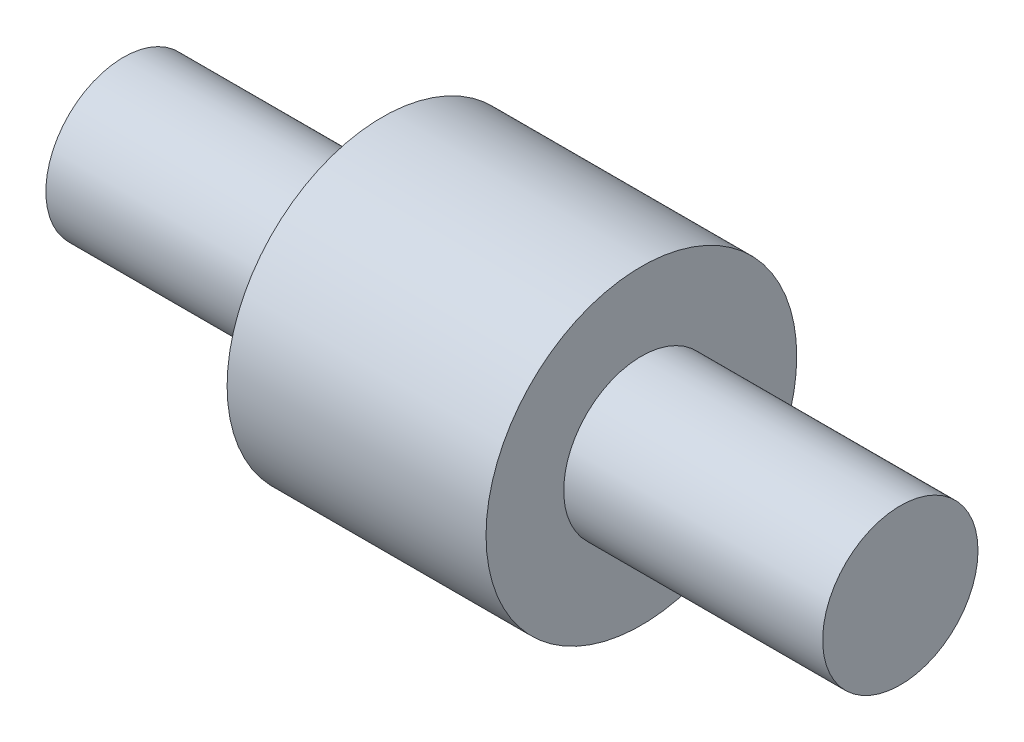
ISO-10303-21;
HEADER;
FILE_DESCRIPTION(('STEP AP214'),'2;1');
FILE_NAME('part.step','',(''),(''),'','','');
FILE_SCHEMA(('AUTOMOTIVE_DESIGN { 1 0 10303 214 1 1 1 1 }'));
ENDSEC;
DATA;
#1=APPLICATION_CONTEXT('core data for automotive mechanical design processes');
#2=APPLICATION_PROTOCOL_DEFINITION('international standard','automotive_design',2000,#1);
#3=PRODUCT_CONTEXT('',#1,'mechanical');
#4=PRODUCT('Part','Part','',(#3));
#5=PRODUCT_RELATED_PRODUCT_CATEGORY('part','',(#4));
#6=PRODUCT_DEFINITION_FORMATION('','',#4);
#7=PRODUCT_DEFINITION_CONTEXT('part definition',#1,'design');
#8=PRODUCT_DEFINITION('design','',#6,#7);
#9=PRODUCT_DEFINITION_SHAPE('','',#8);
#10=(LENGTH_UNIT() NAMED_UNIT(*) SI_UNIT(.MILLI.,.METRE.));
#11=(NAMED_UNIT(*) PLANE_ANGLE_UNIT() SI_UNIT($,.RADIAN.));
#12=(NAMED_UNIT(*) SI_UNIT($,.STERADIAN.) SOLID_ANGLE_UNIT());
#13=UNCERTAINTY_MEASURE_WITH_UNIT(LENGTH_MEASURE(1.E-05),#10,'distance_accuracy_value','');
#14=(GEOMETRIC_REPRESENTATION_CONTEXT(3) GLOBAL_UNCERTAINTY_ASSIGNED_CONTEXT((#13)) GLOBAL_UNIT_ASSIGNED_CONTEXT((#10,
#11,#12)) REPRESENTATION_CONTEXT('',''));
#15=CARTESIAN_POINT('',(0.,0.,0.));
#16=DIRECTION('',(0.,0.,1.));
#17=DIRECTION('',(1.,0.,0.));
#18=AXIS2_PLACEMENT_3D('',#15,#16,#17);
#19=CARTESIAN_POINT('',(0.,0.,0.));
#20=DIRECTION('',(-1.,0.,0.));
#21=DIRECTION('',(0.,0.,1.));
#22=AXIS2_PLACEMENT_3D('',#19,#20,#21);
#23=PLANE('',#22);
#24=CARTESIAN_POINT('',(0.,0.,0.));
#25=DIRECTION('',(1.,0.,0.));
#26=DIRECTION('',(0.,0.,-1.));
#27=AXIS2_PLACEMENT_3D('',#24,#25,#26);
#28=CIRCLE('',#27,1.5);
#29=CARTESIAN_POINT('',(0.,0.,-1.5));
#30=VERTEX_POINT('',#29);
#31=EDGE_CURVE('E10',#30,#30,#28,.T.);
#32=ORIENTED_EDGE('',*,*,#31,.F.);
#33=EDGE_LOOP('',(#32));
#34=FACE_BOUND('',#33,.T.);
#35=ADVANCED_FACE('F30',(#34),#23,.T.);
#36=CARTESIAN_POINT('',(15.,0.,0.));
#37=DIRECTION('',(1.,0.,0.));
#38=DIRECTION('',(0.,0.,-1.));
#39=AXIS2_PLACEMENT_3D('',#36,#37,#38);
#40=CYLINDRICAL_SURFACE('',#39,1.5);
#41=ORIENTED_EDGE('',*,*,#31,.T.);
#42=EDGE_LOOP('',(#41));
#43=FACE_BOUND('',#42,.T.);
#44=CARTESIAN_POINT('',(5.,0.,0.));
#45=DIRECTION('',(1.,0.,0.));
#46=DIRECTION('',(0.,0.,-1.));
#47=AXIS2_PLACEMENT_3D('',#44,#45,#46);
#48=CIRCLE('',#47,1.5);
#49=CARTESIAN_POINT('',(5.,0.,-1.5));
#50=VERTEX_POINT('',#49);
#51=EDGE_CURVE('E36',#50,#50,#48,.T.);
#52=ORIENTED_EDGE('',*,*,#51,.F.);
#53=EDGE_LOOP('',(#52));
#54=FACE_BOUND('',#53,.T.);
#55=ADVANCED_FACE('F72',(#43,#54),#40,.T.);
#56=CARTESIAN_POINT('',(5.,1.5,0.));
#57=DIRECTION('',(-1.,0.,0.));
#58=DIRECTION('',(0.,0.,1.));
#59=AXIS2_PLACEMENT_3D('',#56,#57,#58);
#60=PLANE('',#59);
#61=ORIENTED_EDGE('',*,*,#51,.T.);
#62=EDGE_LOOP('',(#61));
#63=FACE_BOUND('',#62,.T.);
#64=CARTESIAN_POINT('',(5.,0.,0.));
#65=DIRECTION('',(1.,0.,0.));
#66=DIRECTION('',(0.,0.,-1.));
#67=AXIS2_PLACEMENT_3D('',#64,#65,#66);
#68=CIRCLE('',#67,3.);
#69=CARTESIAN_POINT('',(5.,0.,-3.));
#70=VERTEX_POINT('',#69);
#71=EDGE_CURVE('E40',#70,#70,#68,.T.);
#72=ORIENTED_EDGE('',*,*,#71,.F.);
#73=EDGE_LOOP('',(#72));
#74=FACE_BOUND('',#73,.T.);
#75=ADVANCED_FACE('F77',(#63,#74),#60,.T.);
#76=CARTESIAN_POINT('',(15.,0.,0.));
#77=DIRECTION('',(1.,0.,0.));
#78=DIRECTION('',(0.,0.,-1.));
#79=AXIS2_PLACEMENT_3D('',#76,#77,#78);
#80=CYLINDRICAL_SURFACE('',#79,3.);
#81=ORIENTED_EDGE('',*,*,#71,.T.);
#82=EDGE_LOOP('',(#81));
#83=FACE_BOUND('',#82,.T.);
#84=CARTESIAN_POINT('',(10.,0.,0.));
#85=DIRECTION('',(1.,0.,0.));
#86=DIRECTION('',(0.,0.,-1.));
#87=AXIS2_PLACEMENT_3D('',#84,#85,#86);
#88=CIRCLE('',#87,3.);
#89=CARTESIAN_POINT('',(10.,0.,-3.));
#90=VERTEX_POINT('',#89);
#91=EDGE_CURVE('E44',#90,#90,#88,.T.);
#92=ORIENTED_EDGE('',*,*,#91,.F.);
#93=EDGE_LOOP('',(#92));
#94=FACE_BOUND('',#93,.T.);
#95=ADVANCED_FACE('F68',(#83,#94),#80,.T.);
#96=CARTESIAN_POINT('',(10.,3.,0.));
#97=DIRECTION('',(1.,0.,0.));
#98=DIRECTION('',(0.,0.,-1.));
#99=AXIS2_PLACEMENT_3D('',#96,#97,#98);
#100=PLANE('',#99);
#101=ORIENTED_EDGE('',*,*,#91,.T.);
#102=EDGE_LOOP('',(#101));
#103=FACE_BOUND('',#102,.T.);
#104=CARTESIAN_POINT('',(10.,0.,0.));
#105=DIRECTION('',(1.,0.,0.));
#106=DIRECTION('',(0.,0.,-1.));
#107=AXIS2_PLACEMENT_3D('',#104,#105,#106);
#108=CIRCLE('',#107,1.5);
#109=CARTESIAN_POINT('',(10.,0.,-1.5));
#110=VERTEX_POINT('',#109);
#111=EDGE_CURVE('E49',#110,#110,#108,.T.);
#112=ORIENTED_EDGE('',*,*,#111,.F.);
#113=EDGE_LOOP('',(#112));
#114=FACE_BOUND('',#113,.T.);
#115=ADVANCED_FACE('F60',(#103,#114),#100,.T.);
#116=CARTESIAN_POINT('',(15.,0.,0.));
#117=DIRECTION('',(1.,0.,0.));
#118=DIRECTION('',(0.,0.,-1.));
#119=AXIS2_PLACEMENT_3D('',#116,#117,#118);
#120=CYLINDRICAL_SURFACE('',#119,1.5);
#121=ORIENTED_EDGE('',*,*,#111,.T.);
#122=EDGE_LOOP('',(#121));
#123=FACE_BOUND('',#122,.T.);
#124=CARTESIAN_POINT('',(15.,0.,0.));
#125=DIRECTION('',(1.,0.,0.));
#126=DIRECTION('',(0.,0.,-1.));
#127=AXIS2_PLACEMENT_3D('',#124,#125,#126);
#128=CIRCLE('',#127,1.5);
#129=CARTESIAN_POINT('',(15.,0.,-1.5));
#130=VERTEX_POINT('',#129);
#131=EDGE_CURVE('E52',#130,#130,#128,.T.);
#132=ORIENTED_EDGE('',*,*,#131,.F.);
#133=EDGE_LOOP('',(#132));
#134=FACE_BOUND('',#133,.T.);
#135=ADVANCED_FACE('F58',(#123,#134),#120,.T.);
#136=CARTESIAN_POINT('',(15.,1.5,0.));
#137=DIRECTION('',(1.,0.,0.));
#138=DIRECTION('',(0.,0.,-1.));
#139=AXIS2_PLACEMENT_3D('',#136,#137,#138);
#140=PLANE('',#139);
#141=ORIENTED_EDGE('',*,*,#131,.T.);
#142=EDGE_LOOP('',(#141));
#143=FACE_BOUND('',#142,.T.);
#144=ADVANCED_FACE('F56',(#143),#140,.T.);
#145=CLOSED_SHELL('',(#35,#55,#75,#95,#115,#135,#144));
#146=MANIFOLD_SOLID_BREP('B2',#145);
#147=ADVANCED_BREP_SHAPE_REPRESENTATION('',(#18,#146),#14);
#148=SHAPE_DEFINITION_REPRESENTATION(#9,#147);
ENDSEC;
END-ISO-10303-21;
